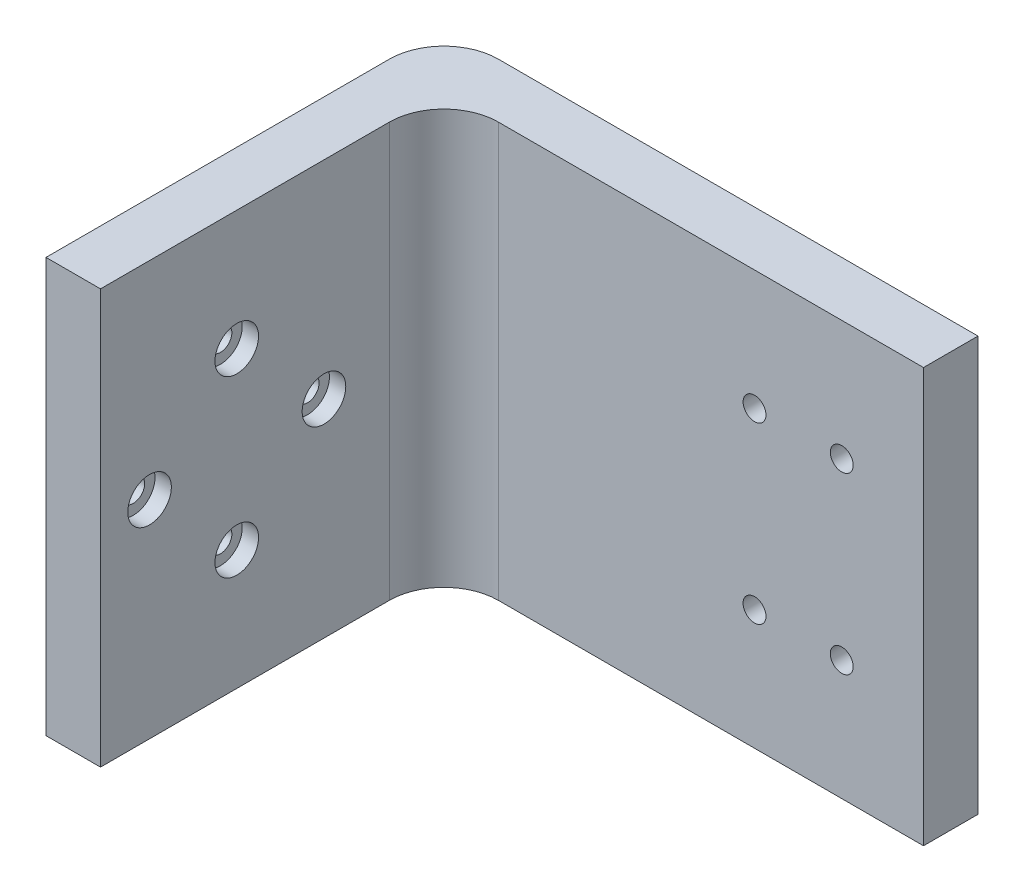
ISO-10303-21;
HEADER;
FILE_DESCRIPTION(('STEP AP214'),'2;1');
FILE_NAME('part.step','',(''),(''),'','','');
FILE_SCHEMA(('AUTOMOTIVE_DESIGN { 1 0 10303 214 1 1 1 1 }'));
ENDSEC;
DATA;
#1=APPLICATION_CONTEXT('core data for automotive mechanical design processes');
#2=APPLICATION_PROTOCOL_DEFINITION('international standard','automotive_design',2000,#1);
#3=PRODUCT_CONTEXT('',#1,'mechanical');
#4=PRODUCT('Part','Part','',(#3));
#5=PRODUCT_RELATED_PRODUCT_CATEGORY('part','',(#4));
#6=PRODUCT_DEFINITION_FORMATION('','',#4);
#7=PRODUCT_DEFINITION_CONTEXT('part definition',#1,'design');
#8=PRODUCT_DEFINITION('design','',#6,#7);
#9=PRODUCT_DEFINITION_SHAPE('','',#8);
#10=(LENGTH_UNIT() NAMED_UNIT(*) SI_UNIT(.MILLI.,.METRE.));
#11=(NAMED_UNIT(*) PLANE_ANGLE_UNIT() SI_UNIT($,.RADIAN.));
#12=(NAMED_UNIT(*) SI_UNIT($,.STERADIAN.) SOLID_ANGLE_UNIT());
#13=UNCERTAINTY_MEASURE_WITH_UNIT(LENGTH_MEASURE(1.E-05),#10,'distance_accuracy_value','');
#14=(GEOMETRIC_REPRESENTATION_CONTEXT(3) GLOBAL_UNCERTAINTY_ASSIGNED_CONTEXT((#13)) GLOBAL_UNIT_ASSIGNED_CONTEXT((#10,
#11,#12)) REPRESENTATION_CONTEXT('',''));
#15=CARTESIAN_POINT('',(0.,0.,0.));
#16=DIRECTION('',(0.,0.,1.));
#17=DIRECTION('',(1.,0.,0.));
#18=AXIS2_PLACEMENT_3D('',#15,#16,#17);
#19=CARTESIAN_POINT('',(5.,8.00000000000001,0.));
#20=DIRECTION('',(-1.,0.,0.));
#21=DIRECTION('',(0.,0.,1.));
#22=AXIS2_PLACEMENT_3D('',#19,#20,#21);
#23=CYLINDRICAL_SURFACE('',#22,1.05);
#24=CARTESIAN_POINT('',(0.,8.00000000000001,0.));
#25=DIRECTION('',(1.,0.,0.));
#26=DIRECTION('',(0.,0.,-1.));
#27=AXIS2_PLACEMENT_3D('',#24,#25,#26);
#28=CIRCLE('',#27,1.05);
#29=CARTESIAN_POINT('',(0.,8.00000000000001,-1.04999999999997));
#30=VERTEX_POINT('',#29);
#31=EDGE_CURVE('E138',#30,#30,#28,.T.);
#32=ORIENTED_EDGE('',*,*,#31,.F.);
#33=EDGE_LOOP('',(#32));
#34=FACE_BOUND('',#33,.T.);
#35=CARTESIAN_POINT('',(3.5,8.00000000000001,0.));
#36=DIRECTION('',(1.,0.,0.));
#37=DIRECTION('',(0.,0.,-1.));
#38=AXIS2_PLACEMENT_3D('',#35,#36,#37);
#39=CIRCLE('',#38,1.05);
#40=CARTESIAN_POINT('',(3.5,8.00000000000001,-1.04999999999997));
#41=VERTEX_POINT('',#40);
#42=EDGE_CURVE('E37',#41,#41,#39,.T.);
#43=ORIENTED_EDGE('',*,*,#42,.T.);
#44=EDGE_LOOP('',(#43));
#45=FACE_BOUND('',#44,.T.);
#46=ADVANCED_FACE('F33',(#34,#45),#23,.F.);
#47=CARTESIAN_POINT('',(5.,0.,-7.99999999999999));
#48=DIRECTION('',(-1.,0.,0.));
#49=DIRECTION('',(0.,0.,1.));
#50=AXIS2_PLACEMENT_3D('',#47,#48,#49);
#51=CYLINDRICAL_SURFACE('',#50,1.05);
#52=CARTESIAN_POINT('',(0.,0.,-7.99999999999999));
#53=DIRECTION('',(1.,0.,0.));
#54=DIRECTION('',(0.,0.,-1.));
#55=AXIS2_PLACEMENT_3D('',#52,#53,#54);
#56=CIRCLE('',#55,1.05);
#57=CARTESIAN_POINT('',(0.,0.,-9.04999999999999));
#58=VERTEX_POINT('',#57);
#59=EDGE_CURVE('E135',#58,#58,#56,.T.);
#60=ORIENTED_EDGE('',*,*,#59,.F.);
#61=EDGE_LOOP('',(#60));
#62=FACE_BOUND('',#61,.T.);
#63=CARTESIAN_POINT('',(3.5,0.,-7.99999999999999));
#64=DIRECTION('',(1.,0.,0.));
#65=DIRECTION('',(0.,0.,-1.));
#66=AXIS2_PLACEMENT_3D('',#63,#64,#65);
#67=CIRCLE('',#66,1.05);
#68=CARTESIAN_POINT('',(3.5,0.,-9.04999999999999));
#69=VERTEX_POINT('',#68);
#70=EDGE_CURVE('E194',#69,#69,#67,.T.);
#71=ORIENTED_EDGE('',*,*,#70,.T.);
#72=EDGE_LOOP('',(#71));
#73=FACE_BOUND('',#72,.T.);
#74=ADVANCED_FACE('F259',(#62,#73),#51,.F.);
#75=CARTESIAN_POINT('',(5.,-8.00000000000001,0.));
#76=DIRECTION('',(-1.,0.,0.));
#77=DIRECTION('',(0.,0.,1.));
#78=AXIS2_PLACEMENT_3D('',#75,#76,#77);
#79=CYLINDRICAL_SURFACE('',#78,1.05);
#80=CARTESIAN_POINT('',(0.,-8.00000000000001,0.));
#81=DIRECTION('',(1.,0.,0.));
#82=DIRECTION('',(0.,0.,-1.));
#83=AXIS2_PLACEMENT_3D('',#80,#81,#82);
#84=CIRCLE('',#83,1.05);
#85=CARTESIAN_POINT('',(0.,-8.00000000000001,-1.05000000000002));
#86=VERTEX_POINT('',#85);
#87=EDGE_CURVE('E123',#86,#86,#84,.T.);
#88=ORIENTED_EDGE('',*,*,#87,.F.);
#89=EDGE_LOOP('',(#88));
#90=FACE_BOUND('',#89,.T.);
#91=CARTESIAN_POINT('',(3.5,-8.00000000000001,0.));
#92=DIRECTION('',(1.,0.,0.));
#93=DIRECTION('',(0.,0.,-1.));
#94=AXIS2_PLACEMENT_3D('',#91,#92,#93);
#95=CIRCLE('',#94,1.05);
#96=CARTESIAN_POINT('',(3.5,-8.00000000000001,-1.05000000000002));
#97=VERTEX_POINT('',#96);
#98=EDGE_CURVE('E191',#97,#97,#95,.T.);
#99=ORIENTED_EDGE('',*,*,#98,.T.);
#100=EDGE_LOOP('',(#99));
#101=FACE_BOUND('',#100,.T.);
#102=ADVANCED_FACE('F265',(#90,#101),#79,.F.);
#103=CARTESIAN_POINT('',(5.,0.,7.99999999999999));
#104=DIRECTION('',(-1.,0.,0.));
#105=DIRECTION('',(0.,0.,1.));
#106=AXIS2_PLACEMENT_3D('',#103,#104,#105);
#107=CYLINDRICAL_SURFACE('',#106,1.05000000000001);
#108=CARTESIAN_POINT('',(0.,0.,7.99999999999999));
#109=DIRECTION('',(1.,0.,0.));
#110=DIRECTION('',(0.,0.,-1.));
#111=AXIS2_PLACEMENT_3D('',#108,#109,#110);
#112=CIRCLE('',#111,1.05000000000001);
#113=CARTESIAN_POINT('',(0.,0.,6.94999999999998));
#114=VERTEX_POINT('',#113);
#115=EDGE_CURVE('E119',#114,#114,#112,.T.);
#116=ORIENTED_EDGE('',*,*,#115,.F.);
#117=EDGE_LOOP('',(#116));
#118=FACE_BOUND('',#117,.T.);
#119=CARTESIAN_POINT('',(3.5,0.,7.99999999999999));
#120=DIRECTION('',(1.,0.,0.));
#121=DIRECTION('',(0.,0.,-1.));
#122=AXIS2_PLACEMENT_3D('',#119,#120,#121);
#123=CIRCLE('',#122,1.05000000000001);
#124=CARTESIAN_POINT('',(3.5,0.,6.94999999999998));
#125=VERTEX_POINT('',#124);
#126=EDGE_CURVE('E188',#125,#125,#123,.T.);
#127=ORIENTED_EDGE('',*,*,#126,.T.);
#128=EDGE_LOOP('',(#127));
#129=FACE_BOUND('',#128,.T.);
#130=ADVANCED_FACE('F393',(#118,#129),#107,.F.);
#131=CARTESIAN_POINT('',(33.5,7.99999999999996,-24.0000000000001));
#132=DIRECTION('',(0.,0.,1.));
#133=DIRECTION('',(1.,0.,0.));
#134=AXIS2_PLACEMENT_3D('',#131,#132,#133);
#135=CYLINDRICAL_SURFACE('',#134,1.05);
#136=CARTESIAN_POINT('',(33.5,7.99999999999996,-19.0000000000001));
#137=DIRECTION('',(0.,0.,1.));
#138=DIRECTION('',(1.,0.,0.));
#139=AXIS2_PLACEMENT_3D('',#136,#137,#138);
#140=CIRCLE('',#139,1.05);
#141=CARTESIAN_POINT('',(34.55,7.99999999999996,-19.0000000000001));
#142=VERTEX_POINT('',#141);
#143=EDGE_CURVE('E131',#142,#142,#140,.T.);
#144=ORIENTED_EDGE('',*,*,#143,.T.);
#145=EDGE_LOOP('',(#144));
#146=FACE_BOUND('',#145,.T.);
#147=CARTESIAN_POINT('',(33.5,7.99999999999996,-22.5000000000001));
#148=DIRECTION('',(0.,0.,-1.));
#149=DIRECTION('',(-1.,0.,0.));
#150=AXIS2_PLACEMENT_3D('',#147,#148,#149);
#151=CIRCLE('',#150,1.05);
#152=CARTESIAN_POINT('',(32.45,7.99999999999996,-22.5000000000001));
#153=VERTEX_POINT('',#152);
#154=EDGE_CURVE('E184',#153,#153,#151,.F.);
#155=ORIENTED_EDGE('',*,*,#154,.F.);
#156=EDGE_LOOP('',(#155));
#157=FACE_BOUND('',#156,.T.);
#158=ADVANCED_FACE('F238',(#146,#157),#135,.F.);
#159=CARTESIAN_POINT('',(33.5000000000001,-8.00000000000006,-24.0000000000001));
#160=DIRECTION('',(0.,0.,1.));
#161=DIRECTION('',(1.,0.,0.));
#162=AXIS2_PLACEMENT_3D('',#159,#160,#161);
#163=CYLINDRICAL_SURFACE('',#162,1.05);
#164=CARTESIAN_POINT('',(33.5000000000001,-8.00000000000006,-19.0000000000001));
#165=DIRECTION('',(0.,0.,1.));
#166=DIRECTION('',(-1.,0.,0.));
#167=AXIS2_PLACEMENT_3D('',#164,#165,#166);
#168=CIRCLE('',#167,1.05);
#169=CARTESIAN_POINT('',(32.4500000000001,-8.00000000000006,-19.0000000000001));
#170=VERTEX_POINT('',#169);
#171=EDGE_CURVE('E228',#170,#170,#168,.T.);
#172=ORIENTED_EDGE('',*,*,#171,.T.);
#173=EDGE_LOOP('',(#172));
#174=FACE_BOUND('',#173,.T.);
#175=CARTESIAN_POINT('',(33.5000000000001,-8.00000000000006,-22.5000000000001));
#176=DIRECTION('',(0.,0.,-1.));
#177=DIRECTION('',(-1.,0.,0.));
#178=AXIS2_PLACEMENT_3D('',#175,#176,#177);
#179=CIRCLE('',#178,1.05);
#180=CARTESIAN_POINT('',(32.4500000000001,-8.00000000000006,-22.5000000000001));
#181=VERTEX_POINT('',#180);
#182=EDGE_CURVE('E181',#181,#181,#179,.F.);
#183=ORIENTED_EDGE('',*,*,#182,.F.);
#184=EDGE_LOOP('',(#183));
#185=FACE_BOUND('',#184,.T.);
#186=ADVANCED_FACE('F381',(#174,#185),#163,.F.);
#187=CARTESIAN_POINT('',(41.5,-8.00000000000006,-24.0000000000001));
#188=DIRECTION('',(0.,0.,1.));
#189=DIRECTION('',(1.,0.,0.));
#190=AXIS2_PLACEMENT_3D('',#187,#188,#189);
#191=CYLINDRICAL_SURFACE('',#190,1.05);
#192=CARTESIAN_POINT('',(41.5,-8.00000000000006,-19.0000000000001));
#193=DIRECTION('',(0.,0.,1.));
#194=DIRECTION('',(1.,0.,0.));
#195=AXIS2_PLACEMENT_3D('',#192,#193,#194);
#196=CIRCLE('',#195,1.05);
#197=CARTESIAN_POINT('',(42.55,-8.00000000000006,-19.0000000000001));
#198=VERTEX_POINT('',#197);
#199=EDGE_CURVE('E231',#198,#198,#196,.T.);
#200=ORIENTED_EDGE('',*,*,#199,.T.);
#201=EDGE_LOOP('',(#200));
#202=FACE_BOUND('',#201,.T.);
#203=CARTESIAN_POINT('',(41.5,-8.00000000000006,-22.5000000000001));
#204=DIRECTION('',(0.,0.,-1.));
#205=DIRECTION('',(-1.,0.,0.));
#206=AXIS2_PLACEMENT_3D('',#203,#204,#205);
#207=CIRCLE('',#206,1.05);
#208=CARTESIAN_POINT('',(40.45,-8.00000000000006,-22.5000000000001));
#209=VERTEX_POINT('',#208);
#210=EDGE_CURVE('E177',#209,#209,#207,.F.);
#211=ORIENTED_EDGE('',*,*,#210,.F.);
#212=EDGE_LOOP('',(#211));
#213=FACE_BOUND('',#212,.T.);
#214=ADVANCED_FACE('F384',(#202,#213),#191,.F.);
#215=CARTESIAN_POINT('',(41.5,7.99999999999996,-24.0000000000001));
#216=DIRECTION('',(0.,0.,1.));
#217=DIRECTION('',(1.,0.,0.));
#218=AXIS2_PLACEMENT_3D('',#215,#216,#217);
#219=CYLINDRICAL_SURFACE('',#218,1.05);
#220=CARTESIAN_POINT('',(41.5,7.99999999999996,-19.0000000000001));
#221=DIRECTION('',(0.,0.,1.));
#222=DIRECTION('',(1.,0.,0.));
#223=AXIS2_PLACEMENT_3D('',#220,#221,#222);
#224=CIRCLE('',#223,1.05);
#225=CARTESIAN_POINT('',(42.55,7.99999999999996,-19.0000000000001));
#226=VERTEX_POINT('',#225);
#227=EDGE_CURVE('E187',#226,#226,#224,.T.);
#228=ORIENTED_EDGE('',*,*,#227,.T.);
#229=EDGE_LOOP('',(#228));
#230=FACE_BOUND('',#229,.T.);
#231=CARTESIAN_POINT('',(41.5,7.99999999999996,-22.5000000000001));
#232=DIRECTION('',(0.,0.,-1.));
#233=DIRECTION('',(-1.,0.,0.));
#234=AXIS2_PLACEMENT_3D('',#231,#232,#233);
#235=CIRCLE('',#234,1.05);
#236=CARTESIAN_POINT('',(40.45,7.99999999999996,-22.5000000000001));
#237=VERTEX_POINT('',#236);
#238=EDGE_CURVE('E174',#237,#237,#235,.F.);
#239=ORIENTED_EDGE('',*,*,#238,.F.);
#240=EDGE_LOOP('',(#239));
#241=FACE_BOUND('',#240,.T.);
#242=ADVANCED_FACE('F275',(#230,#241),#219,.F.);
#243=CARTESIAN_POINT('',(5.,0.,0.));
#244=DIRECTION('',(1.,0.,0.));
#245=DIRECTION('',(0.,0.,-1.));
#246=AXIS2_PLACEMENT_3D('',#243,#244,#245);
#247=PLANE('',#246);
#248=CARTESIAN_POINT('',(5.,8.00000000000001,0.));
#249=DIRECTION('',(1.,0.,0.));
#250=DIRECTION('',(0.,0.,-1.));
#251=AXIS2_PLACEMENT_3D('',#248,#249,#250);
#252=CIRCLE('',#251,2.);
#253=CARTESIAN_POINT('',(5.,8.00000000000001,-1.99999999999997));
#254=VERTEX_POINT('',#253);
#255=EDGE_CURVE('E309',#254,#254,#252,.T.);
#256=ORIENTED_EDGE('',*,*,#255,.F.);
#257=EDGE_LOOP('',(#256));
#258=FACE_BOUND('',#257,.T.);
#259=CARTESIAN_POINT('',(5.,0.,7.99999999999999));
#260=DIRECTION('',(1.,0.,0.));
#261=DIRECTION('',(0.,0.,-1.));
#262=AXIS2_PLACEMENT_3D('',#259,#260,#261);
#263=CIRCLE('',#262,2.);
#264=CARTESIAN_POINT('',(5.,0.,5.99999999999999));
#265=VERTEX_POINT('',#264);
#266=EDGE_CURVE('E315',#265,#265,#263,.T.);
#267=ORIENTED_EDGE('',*,*,#266,.F.);
#268=EDGE_LOOP('',(#267));
#269=FACE_BOUND('',#268,.T.);
#270=CARTESIAN_POINT('',(5.,-8.00000000000001,0.));
#271=DIRECTION('',(1.,0.,0.));
#272=DIRECTION('',(0.,0.,-1.));
#273=AXIS2_PLACEMENT_3D('',#270,#271,#272);
#274=CIRCLE('',#273,2.);
#275=CARTESIAN_POINT('',(5.,-8.00000000000001,-2.00000000000003));
#276=VERTEX_POINT('',#275);
#277=EDGE_CURVE('E321',#276,#276,#274,.T.);
#278=ORIENTED_EDGE('',*,*,#277,.F.);
#279=EDGE_LOOP('',(#278));
#280=FACE_BOUND('',#279,.T.);
#281=CARTESIAN_POINT('',(5.,0.,-7.99999999999999));
#282=DIRECTION('',(1.,0.,0.));
#283=DIRECTION('',(0.,0.,-1.));
#284=AXIS2_PLACEMENT_3D('',#281,#282,#283);
#285=CIRCLE('',#284,2.);
#286=CARTESIAN_POINT('',(5.,0.,-9.99999999999999));
#287=VERTEX_POINT('',#286);
#288=EDGE_CURVE('E306',#287,#287,#285,.T.);
#289=ORIENTED_EDGE('',*,*,#288,.F.);
#290=EDGE_LOOP('',(#289));
#291=FACE_BOUND('',#290,.T.);
#292=DIRECTION('',(0.,0.,-1.));
#293=VECTOR('',#292,1.);
#294=CARTESIAN_POINT('',(5.,-19.,12.4999999999999));
#295=LINE('',#294,#293);
#296=CARTESIAN_POINT('',(5.,-19.,12.4999999999999));
#297=VERTEX_POINT('',#296);
#298=CARTESIAN_POINT('',(5.,-19.,-14.0000000000001));
#299=VERTEX_POINT('',#298);
#300=EDGE_CURVE('E147',#297,#299,#295,.T.);
#301=ORIENTED_EDGE('',*,*,#300,.T.);
#302=DIRECTION('',(0.,1.,0.));
#303=VECTOR('',#302,1.);
#304=CARTESIAN_POINT('',(5.,18.9999999999999,-14.0000000000001));
#305=LINE('',#304,#303);
#306=CARTESIAN_POINT('',(5.,18.9999999999999,-14.0000000000001));
#307=VERTEX_POINT('',#306);
#308=EDGE_CURVE('E169',#299,#307,#305,.T.);
#309=ORIENTED_EDGE('',*,*,#308,.T.);
#310=DIRECTION('',(0.,0.,1.));
#311=VECTOR('',#310,1.);
#312=CARTESIAN_POINT('',(5.,18.9999999999999,-19.0000000000001));
#313=LINE('',#312,#311);
#314=CARTESIAN_POINT('',(5.,18.9999999999999,12.5000000000001));
#315=VERTEX_POINT('',#314);
#316=EDGE_CURVE('E142',#307,#315,#313,.T.);
#317=ORIENTED_EDGE('',*,*,#316,.T.);
#318=DIRECTION('',(0.,-1.,0.));
#319=VECTOR('',#318,1.);
#320=CARTESIAN_POINT('',(5.,18.9999999999999,12.5000000000001));
#321=LINE('',#320,#319);
#322=EDGE_CURVE('E144',#315,#297,#321,.T.);
#323=ORIENTED_EDGE('',*,*,#322,.T.);
#324=EDGE_LOOP('',(#301,#309,#317,#323));
#325=FACE_BOUND('',#324,.T.);
#326=ADVANCED_FACE('F271',(#258,#269,#280,#291,#325),#247,.T.);
#327=CARTESIAN_POINT('',(0.,0.,0.));
#328=DIRECTION('',(1.,0.,0.));
#329=DIRECTION('',(0.,0.,-1.));
#330=AXIS2_PLACEMENT_3D('',#327,#328,#329);
#331=PLANE('',#330);
#332=DIRECTION('',(0.,0.,1.));
#333=VECTOR('',#332,1.);
#334=CARTESIAN_POINT('',(0.,18.9999999999999,-19.0000000000001));
#335=LINE('',#334,#333);
#336=CARTESIAN_POINT('',(0.,18.9999999999999,-19.0000000000001));
#337=VERTEX_POINT('',#336);
#338=CARTESIAN_POINT('',(0.,18.9999999999999,12.5000000000001));
#339=VERTEX_POINT('',#338);
#340=EDGE_CURVE('E141',#337,#339,#335,.T.);
#341=ORIENTED_EDGE('',*,*,#340,.F.);
#342=DIRECTION('',(0.,-1.,0.));
#343=VECTOR('',#342,1.);
#344=CARTESIAN_POINT('',(0.,0.,-19.0000000000001));
#345=LINE('',#344,#343);
#346=CARTESIAN_POINT('',(0.,-18.9999999999999,-19.0000000000001));
#347=VERTEX_POINT('',#346);
#348=EDGE_CURVE('E161',#337,#347,#345,.T.);
#349=ORIENTED_EDGE('',*,*,#348,.T.);
#350=DIRECTION('',(0.,0.,-1.));
#351=VECTOR('',#350,1.);
#352=CARTESIAN_POINT('',(0.,-19.,12.4999999999999));
#353=LINE('',#352,#351);
#354=CARTESIAN_POINT('',(0.,-19.,12.4999999999999));
#355=VERTEX_POINT('',#354);
#356=EDGE_CURVE('E145',#355,#347,#353,.T.);
#357=ORIENTED_EDGE('',*,*,#356,.F.);
#358=DIRECTION('',(0.,-1.,0.));
#359=VECTOR('',#358,1.);
#360=CARTESIAN_POINT('',(0.,18.9999999999999,12.5000000000001));
#361=LINE('',#360,#359);
#362=EDGE_CURVE('E152',#339,#355,#361,.T.);
#363=ORIENTED_EDGE('',*,*,#362,.F.);
#364=EDGE_LOOP('',(#341,#349,#357,#363));
#365=FACE_BOUND('',#364,.T.);
#366=ORIENTED_EDGE('',*,*,#31,.T.);
#367=EDGE_LOOP('',(#366));
#368=FACE_BOUND('',#367,.T.);
#369=ORIENTED_EDGE('',*,*,#59,.T.);
#370=EDGE_LOOP('',(#369));
#371=FACE_BOUND('',#370,.T.);
#372=ORIENTED_EDGE('',*,*,#87,.T.);
#373=EDGE_LOOP('',(#372));
#374=FACE_BOUND('',#373,.T.);
#375=ORIENTED_EDGE('',*,*,#115,.T.);
#376=EDGE_LOOP('',(#375));
#377=FACE_BOUND('',#376,.T.);
#378=ADVANCED_FACE('F274',(#365,#368,#371,#374,#377),#331,.F.);
#379=CARTESIAN_POINT('',(5.,18.9999999999999,-19.0000000000001));
#380=DIRECTION('',(0.,-1.,0.));
#381=DIRECTION('',(0.,0.,-1.));
#382=AXIS2_PLACEMENT_3D('',#379,#380,#381);
#383=PLANE('',#382);
#384=DIRECTION('',(1.,0.,0.));
#385=VECTOR('',#384,1.);
#386=CARTESIAN_POINT('',(0.,18.9999999999999,-19.0000000000001));
#387=LINE('',#386,#385);
#388=CARTESIAN_POINT('',(10.,18.9999999999999,-19.0000000000001));
#389=VERTEX_POINT('',#388);
#390=CARTESIAN_POINT('',(49.,18.9999999999999,-19.0000000000001));
#391=VERTEX_POINT('',#390);
#392=EDGE_CURVE('E114',#389,#391,#387,.T.);
#393=ORIENTED_EDGE('',*,*,#392,.T.);
#394=DIRECTION('',(0.,0.,1.));
#395=VECTOR('',#394,1.);
#396=CARTESIAN_POINT('',(49.,18.9999999999999,-24.0000000000001));
#397=LINE('',#396,#395);
#398=CARTESIAN_POINT('',(49.,18.9999999999999,-24.0000000000001));
#399=VERTEX_POINT('',#398);
#400=EDGE_CURVE('E99',#399,#391,#397,.T.);
#401=ORIENTED_EDGE('',*,*,#400,.F.);
#402=DIRECTION('',(1.,0.,0.));
#403=VECTOR('',#402,1.);
#404=CARTESIAN_POINT('',(0.,18.9999999999999,-24.0000000000001));
#405=LINE('',#404,#403);
#406=CARTESIAN_POINT('',(5.,18.9999999999999,-24.0000000000001));
#407=VERTEX_POINT('',#406);
#408=EDGE_CURVE('E111',#407,#399,#405,.T.);
#409=ORIENTED_EDGE('',*,*,#408,.F.);
#410=CARTESIAN_POINT('',(5.,18.9999999999999,-19.0000000000001));
#411=DIRECTION('',(0.,-1.,0.));
#412=DIRECTION('',(0.,0.,-1.));
#413=AXIS2_PLACEMENT_3D('',#410,#411,#412);
#414=CIRCLE('',#413,5.);
#415=EDGE_CURVE('E167',#407,#337,#414,.F.);
#416=ORIENTED_EDGE('',*,*,#415,.T.);
#417=ORIENTED_EDGE('',*,*,#340,.T.);
#418=DIRECTION('',(-1.,0.,0.));
#419=VECTOR('',#418,1.);
#420=CARTESIAN_POINT('',(5.,18.9999999999999,12.5000000000001));
#421=LINE('',#420,#419);
#422=EDGE_CURVE('E158',#315,#339,#421,.T.);
#423=ORIENTED_EDGE('',*,*,#422,.F.);
#424=ORIENTED_EDGE('',*,*,#316,.F.);
#425=CARTESIAN_POINT('',(10.,18.9999999999999,-14.0000000000001));
#426=DIRECTION('',(0.,-1.,0.));
#427=DIRECTION('',(0.,0.,-1.));
#428=AXIS2_PLACEMENT_3D('',#425,#426,#427);
#429=CIRCLE('',#428,5.);
#430=EDGE_CURVE('E42',#307,#389,#429,.T.);
#431=ORIENTED_EDGE('',*,*,#430,.T.);
#432=EDGE_LOOP('',(#393,#401,#409,#416,#417,#423,#424,#431));
#433=FACE_BOUND('',#432,.T.);
#434=ADVANCED_FACE('F110',(#433),#383,.F.);
#435=CARTESIAN_POINT('',(5.,18.9999999999999,12.5000000000001));
#436=DIRECTION('',(0.,0.,-1.));
#437=DIRECTION('',(0.,1.,0.));
#438=AXIS2_PLACEMENT_3D('',#435,#436,#437);
#439=PLANE('',#438);
#440=ORIENTED_EDGE('',*,*,#362,.T.);
#441=DIRECTION('',(-1.,0.,0.));
#442=VECTOR('',#441,1.);
#443=CARTESIAN_POINT('',(5.,-19.,12.4999999999999));
#444=LINE('',#443,#442);
#445=EDGE_CURVE('E150',#297,#355,#444,.T.);
#446=ORIENTED_EDGE('',*,*,#445,.F.);
#447=ORIENTED_EDGE('',*,*,#322,.F.);
#448=ORIENTED_EDGE('',*,*,#422,.T.);
#449=EDGE_LOOP('',(#440,#446,#447,#448));
#450=FACE_BOUND('',#449,.T.);
#451=ADVANCED_FACE('F253',(#450),#439,.F.);
#452=CARTESIAN_POINT('',(5.,-19.,12.4999999999999));
#453=DIRECTION('',(0.,1.,0.));
#454=DIRECTION('',(0.,0.,1.));
#455=AXIS2_PLACEMENT_3D('',#452,#453,#454);
#456=PLANE('',#455);
#457=DIRECTION('',(1.,0.,0.));
#458=VECTOR('',#457,1.);
#459=CARTESIAN_POINT('',(0.,-18.9999999999999,-24.0000000000001));
#460=LINE('',#459,#458);
#461=CARTESIAN_POINT('',(5.,-18.9999999999999,-24.0000000000001));
#462=VERTEX_POINT('',#461);
#463=CARTESIAN_POINT('',(49.,-18.9999999999999,-24.0000000000001));
#464=VERTEX_POINT('',#463);
#465=EDGE_CURVE('E120',#462,#464,#460,.T.);
#466=ORIENTED_EDGE('',*,*,#465,.T.);
#467=DIRECTION('',(0.,0.,1.));
#468=VECTOR('',#467,1.);
#469=CARTESIAN_POINT('',(49.,-19.,-24.0000000000001));
#470=LINE('',#469,#468);
#471=CARTESIAN_POINT('',(49.,-19.,-19.0000000000001));
#472=VERTEX_POINT('',#471);
#473=EDGE_CURVE('E50',#464,#472,#470,.T.);
#474=ORIENTED_EDGE('',*,*,#473,.T.);
#475=DIRECTION('',(1.,0.,0.));
#476=VECTOR('',#475,1.);
#477=CARTESIAN_POINT('',(0.,-18.9999999999999,-19.0000000000001));
#478=LINE('',#477,#476);
#479=CARTESIAN_POINT('',(10.,-18.9999999999999,-19.0000000000001));
#480=VERTEX_POINT('',#479);
#481=EDGE_CURVE('E128',#480,#472,#478,.T.);
#482=ORIENTED_EDGE('',*,*,#481,.F.);
#483=CARTESIAN_POINT('',(10.,-19.,-14.0000000000001));
#484=DIRECTION('',(0.,1.,0.));
#485=DIRECTION('',(0.,0.,1.));
#486=AXIS2_PLACEMENT_3D('',#483,#484,#485);
#487=CIRCLE('',#486,5.);
#488=EDGE_CURVE('E11',#480,#299,#487,.T.);
#489=ORIENTED_EDGE('',*,*,#488,.T.);
#490=ORIENTED_EDGE('',*,*,#300,.F.);
#491=ORIENTED_EDGE('',*,*,#445,.T.);
#492=ORIENTED_EDGE('',*,*,#356,.T.);
#493=CARTESIAN_POINT('',(5.,-18.9999999999999,-19.0000000000001));
#494=DIRECTION('',(0.,1.,0.));
#495=DIRECTION('',(0.,0.,1.));
#496=AXIS2_PLACEMENT_3D('',#493,#494,#495);
#497=CIRCLE('',#496,5.);
#498=EDGE_CURVE('E164',#347,#462,#497,.F.);
#499=ORIENTED_EDGE('',*,*,#498,.T.);
#500=EDGE_LOOP('',(#466,#474,#482,#489,#490,#491,#492,#499));
#501=FACE_BOUND('',#500,.T.);
#502=ADVANCED_FACE('F243',(#501),#456,.F.);
#503=CARTESIAN_POINT('',(0.,0.,-19.0000000000001));
#504=DIRECTION('',(0.,0.,1.));
#505=DIRECTION('',(1.,0.,0.));
#506=AXIS2_PLACEMENT_3D('',#503,#504,#505);
#507=PLANE('',#506);
#508=DIRECTION('',(0.,-1.,0.));
#509=VECTOR('',#508,1.);
#510=CARTESIAN_POINT('',(49.,0.,-19.0000000000001));
#511=LINE('',#510,#509);
#512=EDGE_CURVE('E105',#391,#472,#511,.T.);
#513=ORIENTED_EDGE('',*,*,#512,.F.);
#514=ORIENTED_EDGE('',*,*,#392,.F.);
#515=DIRECTION('',(0.,1.,0.));
#516=VECTOR('',#515,1.);
#517=CARTESIAN_POINT('',(10.,-18.9999999999999,-19.0000000000001));
#518=LINE('',#517,#516);
#519=EDGE_CURVE('E171',#389,#480,#518,.F.);
#520=ORIENTED_EDGE('',*,*,#519,.T.);
#521=ORIENTED_EDGE('',*,*,#481,.T.);
#522=EDGE_LOOP('',(#513,#514,#520,#521));
#523=FACE_BOUND('',#522,.T.);
#524=ORIENTED_EDGE('',*,*,#227,.F.);
#525=EDGE_LOOP('',(#524));
#526=FACE_BOUND('',#525,.T.);
#527=ORIENTED_EDGE('',*,*,#199,.F.);
#528=EDGE_LOOP('',(#527));
#529=FACE_BOUND('',#528,.T.);
#530=ORIENTED_EDGE('',*,*,#171,.F.);
#531=EDGE_LOOP('',(#530));
#532=FACE_BOUND('',#531,.T.);
#533=ORIENTED_EDGE('',*,*,#143,.F.);
#534=EDGE_LOOP('',(#533));
#535=FACE_BOUND('',#534,.T.);
#536=ADVANCED_FACE('F241',(#523,#526,#529,#532,#535),#507,.T.);
#537=CARTESIAN_POINT('',(0.,0.,-24.0000000000001));
#538=DIRECTION('',(0.,0.,1.));
#539=DIRECTION('',(1.,0.,0.));
#540=AXIS2_PLACEMENT_3D('',#537,#538,#539);
#541=PLANE('',#540);
#542=CARTESIAN_POINT('',(33.5,7.99999999999996,-24.0000000000001));
#543=DIRECTION('',(0.,0.,-1.));
#544=DIRECTION('',(-1.,0.,0.));
#545=AXIS2_PLACEMENT_3D('',#542,#543,#544);
#546=CIRCLE('',#545,2.);
#547=CARTESIAN_POINT('',(31.5,7.99999999999996,-24.0000000000001));
#548=VERTEX_POINT('',#547);
#549=EDGE_CURVE('E216',#548,#548,#546,.T.);
#550=ORIENTED_EDGE('',*,*,#549,.F.);
#551=EDGE_LOOP('',(#550));
#552=FACE_BOUND('',#551,.T.);
#553=CARTESIAN_POINT('',(41.5,-8.00000000000006,-24.0000000000001));
#554=DIRECTION('',(0.,0.,-1.));
#555=DIRECTION('',(-1.,0.,0.));
#556=AXIS2_PLACEMENT_3D('',#553,#554,#555);
#557=CIRCLE('',#556,2.);
#558=CARTESIAN_POINT('',(39.5,-8.00000000000006,-24.0000000000001));
#559=VERTEX_POINT('',#558);
#560=EDGE_CURVE('E208',#559,#559,#557,.T.);
#561=ORIENTED_EDGE('',*,*,#560,.F.);
#562=EDGE_LOOP('',(#561));
#563=FACE_BOUND('',#562,.T.);
#564=CARTESIAN_POINT('',(33.5000000000001,-8.00000000000006,-24.0000000000001));
#565=DIRECTION('',(0.,0.,-1.));
#566=DIRECTION('',(-1.,0.,0.));
#567=AXIS2_PLACEMENT_3D('',#564,#565,#566);
#568=CIRCLE('',#567,2.);
#569=CARTESIAN_POINT('',(31.5000000000001,-8.00000000000006,-24.0000000000001));
#570=VERTEX_POINT('',#569);
#571=EDGE_CURVE('E199',#570,#570,#568,.T.);
#572=ORIENTED_EDGE('',*,*,#571,.F.);
#573=EDGE_LOOP('',(#572));
#574=FACE_BOUND('',#573,.T.);
#575=CARTESIAN_POINT('',(41.5,7.99999999999996,-24.0000000000001));
#576=DIRECTION('',(0.,0.,-1.));
#577=DIRECTION('',(-1.,0.,0.));
#578=AXIS2_PLACEMENT_3D('',#575,#576,#577);
#579=CIRCLE('',#578,2.);
#580=CARTESIAN_POINT('',(39.5,7.99999999999996,-24.0000000000001));
#581=VERTEX_POINT('',#580);
#582=EDGE_CURVE('E215',#581,#581,#579,.T.);
#583=ORIENTED_EDGE('',*,*,#582,.F.);
#584=EDGE_LOOP('',(#583));
#585=FACE_BOUND('',#584,.T.);
#586=ORIENTED_EDGE('',*,*,#408,.T.);
#587=DIRECTION('',(0.,1.,0.));
#588=VECTOR('',#587,1.);
#589=CARTESIAN_POINT('',(49.,-19.,-24.0000000000001));
#590=LINE('',#589,#588);
#591=EDGE_CURVE('E96',#464,#399,#590,.T.);
#592=ORIENTED_EDGE('',*,*,#591,.F.);
#593=ORIENTED_EDGE('',*,*,#465,.F.);
#594=DIRECTION('',(0.,-1.,0.));
#595=VECTOR('',#594,1.);
#596=CARTESIAN_POINT('',(5.,0.,-24.0000000000001));
#597=LINE('',#596,#595);
#598=EDGE_CURVE('E118',#462,#407,#597,.F.);
#599=ORIENTED_EDGE('',*,*,#598,.T.);
#600=EDGE_LOOP('',(#586,#592,#593,#599));
#601=FACE_BOUND('',#600,.T.);
#602=ADVANCED_FACE('F116',(#552,#563,#574,#585,#601),#541,.F.);
#603=CARTESIAN_POINT('',(5.,0.,-19.0000000000001));
#604=DIRECTION('',(0.,-1.,0.));
#605=DIRECTION('',(0.,0.,-1.));
#606=AXIS2_PLACEMENT_3D('',#603,#604,#605);
#607=CYLINDRICAL_SURFACE('',#606,5.);
#608=ORIENTED_EDGE('',*,*,#415,.F.);
#609=ORIENTED_EDGE('',*,*,#598,.F.);
#610=ORIENTED_EDGE('',*,*,#498,.F.);
#611=ORIENTED_EDGE('',*,*,#348,.F.);
#612=EDGE_LOOP('',(#608,#609,#610,#611));
#613=FACE_BOUND('',#612,.T.);
#614=ADVANCED_FACE('F250',(#613),#607,.T.);
#615=CARTESIAN_POINT('',(10.,0.,-14.0000000000001));
#616=DIRECTION('',(0.,-1.,0.));
#617=DIRECTION('',(0.,0.,-1.));
#618=AXIS2_PLACEMENT_3D('',#615,#616,#617);
#619=CYLINDRICAL_SURFACE('',#618,5.);
#620=ORIENTED_EDGE('',*,*,#488,.F.);
#621=ORIENTED_EDGE('',*,*,#519,.F.);
#622=ORIENTED_EDGE('',*,*,#430,.F.);
#623=ORIENTED_EDGE('',*,*,#308,.F.);
#624=EDGE_LOOP('',(#620,#621,#622,#623));
#625=FACE_BOUND('',#624,.T.);
#626=ADVANCED_FACE('F35',(#625),#619,.F.);
#627=CARTESIAN_POINT('',(41.5,7.99999999999996,-22.5000000000001));
#628=DIRECTION('',(0.,0.,-1.));
#629=DIRECTION('',(-1.,0.,0.));
#630=AXIS2_PLACEMENT_3D('',#627,#628,#629);
#631=PLANE('',#630);
#632=CARTESIAN_POINT('',(41.5,7.99999999999996,-22.5000000000001));
#633=DIRECTION('',(0.,0.,-1.));
#634=DIRECTION('',(-1.,0.,0.));
#635=AXIS2_PLACEMENT_3D('',#632,#633,#634);
#636=CIRCLE('',#635,2.);
#637=CARTESIAN_POINT('',(39.5,7.99999999999996,-22.5000000000001));
#638=VERTEX_POINT('',#637);
#639=EDGE_CURVE('E178',#638,#638,#636,.T.);
#640=ORIENTED_EDGE('',*,*,#639,.T.);
#641=EDGE_LOOP('',(#640));
#642=FACE_BOUND('',#641,.T.);
#643=ORIENTED_EDGE('',*,*,#238,.T.);
#644=EDGE_LOOP('',(#643));
#645=FACE_BOUND('',#644,.T.);
#646=ADVANCED_FACE('F289',(#642,#645),#631,.T.);
#647=CARTESIAN_POINT('',(41.5,7.99999999999996,-22.5000000000001));
#648=DIRECTION('',(0.,0.,-1.));
#649=DIRECTION('',(-1.,0.,0.));
#650=AXIS2_PLACEMENT_3D('',#647,#648,#649);
#651=CYLINDRICAL_SURFACE('',#650,2.);
#652=ORIENTED_EDGE('',*,*,#639,.F.);
#653=EDGE_LOOP('',(#652));
#654=FACE_BOUND('',#653,.T.);
#655=ORIENTED_EDGE('',*,*,#582,.T.);
#656=EDGE_LOOP('',(#655));
#657=FACE_BOUND('',#656,.T.);
#658=ADVANCED_FACE('F370',(#654,#657),#651,.F.);
#659=CARTESIAN_POINT('',(41.5,-8.00000000000006,-22.5000000000001));
#660=DIRECTION('',(0.,0.,-1.));
#661=DIRECTION('',(-1.,0.,0.));
#662=AXIS2_PLACEMENT_3D('',#659,#660,#661);
#663=PLANE('',#662);
#664=CARTESIAN_POINT('',(41.5,-8.00000000000006,-22.5000000000001));
#665=DIRECTION('',(0.,0.,-1.));
#666=DIRECTION('',(-1.,0.,0.));
#667=AXIS2_PLACEMENT_3D('',#664,#665,#666);
#668=CIRCLE('',#667,2.);
#669=CARTESIAN_POINT('',(39.5,-8.00000000000006,-22.5000000000001));
#670=VERTEX_POINT('',#669);
#671=EDGE_CURVE('E219',#670,#670,#668,.T.);
#672=ORIENTED_EDGE('',*,*,#671,.T.);
#673=EDGE_LOOP('',(#672));
#674=FACE_BOUND('',#673,.T.);
#675=ORIENTED_EDGE('',*,*,#210,.T.);
#676=EDGE_LOOP('',(#675));
#677=FACE_BOUND('',#676,.T.);
#678=ADVANCED_FACE('F367',(#674,#677),#663,.T.);
#679=CARTESIAN_POINT('',(41.5,-8.00000000000006,-22.5000000000001));
#680=DIRECTION('',(0.,0.,-1.));
#681=DIRECTION('',(-1.,0.,0.));
#682=AXIS2_PLACEMENT_3D('',#679,#680,#681);
#683=CYLINDRICAL_SURFACE('',#682,2.);
#684=ORIENTED_EDGE('',*,*,#671,.F.);
#685=EDGE_LOOP('',(#684));
#686=FACE_BOUND('',#685,.T.);
#687=ORIENTED_EDGE('',*,*,#560,.T.);
#688=EDGE_LOOP('',(#687));
#689=FACE_BOUND('',#688,.T.);
#690=ADVANCED_FACE('F353',(#686,#689),#683,.F.);
#691=CARTESIAN_POINT('',(33.5000000000001,-8.00000000000006,-22.5000000000001));
#692=DIRECTION('',(0.,0.,-1.));
#693=DIRECTION('',(-1.,0.,0.));
#694=AXIS2_PLACEMENT_3D('',#691,#692,#693);
#695=PLANE('',#694);
#696=CARTESIAN_POINT('',(33.5000000000001,-8.00000000000006,-22.5000000000001));
#697=DIRECTION('',(0.,0.,-1.));
#698=DIRECTION('',(-1.,0.,0.));
#699=AXIS2_PLACEMENT_3D('',#696,#697,#698);
#700=CIRCLE('',#699,2.);
#701=CARTESIAN_POINT('',(31.5000000000001,-8.00000000000006,-22.5000000000001));
#702=VERTEX_POINT('',#701);
#703=EDGE_CURVE('E203',#702,#702,#700,.T.);
#704=ORIENTED_EDGE('',*,*,#703,.T.);
#705=EDGE_LOOP('',(#704));
#706=FACE_BOUND('',#705,.T.);
#707=ORIENTED_EDGE('',*,*,#182,.T.);
#708=EDGE_LOOP('',(#707));
#709=FACE_BOUND('',#708,.T.);
#710=ADVANCED_FACE('F349',(#706,#709),#695,.T.);
#711=CARTESIAN_POINT('',(33.5000000000001,-8.00000000000006,-22.5000000000001));
#712=DIRECTION('',(0.,0.,-1.));
#713=DIRECTION('',(-1.,0.,0.));
#714=AXIS2_PLACEMENT_3D('',#711,#712,#713);
#715=CYLINDRICAL_SURFACE('',#714,2.);
#716=ORIENTED_EDGE('',*,*,#703,.F.);
#717=EDGE_LOOP('',(#716));
#718=FACE_BOUND('',#717,.T.);
#719=ORIENTED_EDGE('',*,*,#571,.T.);
#720=EDGE_LOOP('',(#719));
#721=FACE_BOUND('',#720,.T.);
#722=ADVANCED_FACE('F352',(#718,#721),#715,.F.);
#723=CARTESIAN_POINT('',(33.5,7.99999999999996,-22.5000000000001));
#724=DIRECTION('',(0.,0.,-1.));
#725=DIRECTION('',(-1.,0.,0.));
#726=AXIS2_PLACEMENT_3D('',#723,#724,#725);
#727=PLANE('',#726);
#728=CARTESIAN_POINT('',(33.5,7.99999999999996,-22.5000000000001));
#729=DIRECTION('',(0.,0.,-1.));
#730=DIRECTION('',(-1.,0.,0.));
#731=AXIS2_PLACEMENT_3D('',#728,#729,#730);
#732=CIRCLE('',#731,2.);
#733=CARTESIAN_POINT('',(31.5,7.99999999999996,-22.5000000000001));
#734=VERTEX_POINT('',#733);
#735=EDGE_CURVE('E212',#734,#734,#732,.T.);
#736=ORIENTED_EDGE('',*,*,#735,.T.);
#737=EDGE_LOOP('',(#736));
#738=FACE_BOUND('',#737,.T.);
#739=ORIENTED_EDGE('',*,*,#154,.T.);
#740=EDGE_LOOP('',(#739));
#741=FACE_BOUND('',#740,.T.);
#742=ADVANCED_FACE('F357',(#738,#741),#727,.T.);
#743=CARTESIAN_POINT('',(33.5,7.99999999999996,-22.5000000000001));
#744=DIRECTION('',(0.,0.,-1.));
#745=DIRECTION('',(-1.,0.,0.));
#746=AXIS2_PLACEMENT_3D('',#743,#744,#745);
#747=CYLINDRICAL_SURFACE('',#746,2.);
#748=ORIENTED_EDGE('',*,*,#735,.F.);
#749=EDGE_LOOP('',(#748));
#750=FACE_BOUND('',#749,.T.);
#751=ORIENTED_EDGE('',*,*,#549,.T.);
#752=EDGE_LOOP('',(#751));
#753=FACE_BOUND('',#752,.T.);
#754=ADVANCED_FACE('F361',(#750,#753),#747,.F.);
#755=CARTESIAN_POINT('',(3.5,0.,7.99999999999999));
#756=DIRECTION('',(1.,0.,0.));
#757=DIRECTION('',(0.,0.,-1.));
#758=AXIS2_PLACEMENT_3D('',#755,#756,#757);
#759=CYLINDRICAL_SURFACE('',#758,2.);
#760=CARTESIAN_POINT('',(3.5,0.,7.99999999999999));
#761=DIRECTION('',(1.,0.,0.));
#762=DIRECTION('',(0.,0.,-1.));
#763=AXIS2_PLACEMENT_3D('',#760,#761,#762);
#764=CIRCLE('',#763,2.);
#765=CARTESIAN_POINT('',(3.5,0.,5.99999999999999));
#766=VERTEX_POINT('',#765);
#767=EDGE_CURVE('E312',#766,#766,#764,.T.);
#768=ORIENTED_EDGE('',*,*,#767,.F.);
#769=EDGE_LOOP('',(#768));
#770=FACE_BOUND('',#769,.T.);
#771=ORIENTED_EDGE('',*,*,#266,.T.);
#772=EDGE_LOOP('',(#771));
#773=FACE_BOUND('',#772,.T.);
#774=ADVANCED_FACE('F365',(#770,#773),#759,.F.);
#775=CARTESIAN_POINT('',(3.5,0.,7.99999999999999));
#776=DIRECTION('',(1.,0.,0.));
#777=DIRECTION('',(0.,0.,-1.));
#778=AXIS2_PLACEMENT_3D('',#775,#776,#777);
#779=PLANE('',#778);
#780=ORIENTED_EDGE('',*,*,#126,.F.);
#781=EDGE_LOOP('',(#780));
#782=FACE_BOUND('',#781,.T.);
#783=ORIENTED_EDGE('',*,*,#767,.T.);
#784=EDGE_LOOP('',(#783));
#785=FACE_BOUND('',#784,.T.);
#786=ADVANCED_FACE('F406',(#782,#785),#779,.T.);
#787=CARTESIAN_POINT('',(3.5,-8.00000000000001,0.));
#788=DIRECTION('',(1.,0.,0.));
#789=DIRECTION('',(0.,0.,-1.));
#790=AXIS2_PLACEMENT_3D('',#787,#788,#789);
#791=CYLINDRICAL_SURFACE('',#790,2.);
#792=CARTESIAN_POINT('',(3.5,-8.00000000000001,0.));
#793=DIRECTION('',(1.,0.,0.));
#794=DIRECTION('',(0.,0.,-1.));
#795=AXIS2_PLACEMENT_3D('',#792,#793,#794);
#796=CIRCLE('',#795,2.);
#797=CARTESIAN_POINT('',(3.5,-8.00000000000001,-2.00000000000003));
#798=VERTEX_POINT('',#797);
#799=EDGE_CURVE('E318',#798,#798,#796,.T.);
#800=ORIENTED_EDGE('',*,*,#799,.F.);
#801=EDGE_LOOP('',(#800));
#802=FACE_BOUND('',#801,.T.);
#803=ORIENTED_EDGE('',*,*,#277,.T.);
#804=EDGE_LOOP('',(#803));
#805=FACE_BOUND('',#804,.T.);
#806=ADVANCED_FACE('F343',(#802,#805),#791,.F.);
#807=CARTESIAN_POINT('',(3.5,-8.00000000000001,0.));
#808=DIRECTION('',(1.,0.,0.));
#809=DIRECTION('',(0.,0.,-1.));
#810=AXIS2_PLACEMENT_3D('',#807,#808,#809);
#811=PLANE('',#810);
#812=ORIENTED_EDGE('',*,*,#98,.F.);
#813=EDGE_LOOP('',(#812));
#814=FACE_BOUND('',#813,.T.);
#815=ORIENTED_EDGE('',*,*,#799,.T.);
#816=EDGE_LOOP('',(#815));
#817=FACE_BOUND('',#816,.T.);
#818=ADVANCED_FACE('F333',(#814,#817),#811,.T.);
#819=CARTESIAN_POINT('',(3.5,0.,-7.99999999999999));
#820=DIRECTION('',(1.,0.,0.));
#821=DIRECTION('',(0.,0.,-1.));
#822=AXIS2_PLACEMENT_3D('',#819,#820,#821);
#823=CYLINDRICAL_SURFACE('',#822,2.);
#824=CARTESIAN_POINT('',(3.5,0.,-7.99999999999999));
#825=DIRECTION('',(1.,0.,0.));
#826=DIRECTION('',(0.,0.,-1.));
#827=AXIS2_PLACEMENT_3D('',#824,#825,#826);
#828=CIRCLE('',#827,2.);
#829=CARTESIAN_POINT('',(3.5,0.,-9.99999999999999));
#830=VERTEX_POINT('',#829);
#831=EDGE_CURVE('E324',#830,#830,#828,.T.);
#832=ORIENTED_EDGE('',*,*,#831,.F.);
#833=EDGE_LOOP('',(#832));
#834=FACE_BOUND('',#833,.T.);
#835=ORIENTED_EDGE('',*,*,#288,.T.);
#836=EDGE_LOOP('',(#835));
#837=FACE_BOUND('',#836,.T.);
#838=ADVANCED_FACE('F329',(#834,#837),#823,.F.);
#839=CARTESIAN_POINT('',(3.5,0.,-7.99999999999999));
#840=DIRECTION('',(1.,0.,0.));
#841=DIRECTION('',(0.,0.,-1.));
#842=AXIS2_PLACEMENT_3D('',#839,#840,#841);
#843=PLANE('',#842);
#844=ORIENTED_EDGE('',*,*,#70,.F.);
#845=EDGE_LOOP('',(#844));
#846=FACE_BOUND('',#845,.T.);
#847=ORIENTED_EDGE('',*,*,#831,.T.);
#848=EDGE_LOOP('',(#847));
#849=FACE_BOUND('',#848,.T.);
#850=ADVANCED_FACE('F332',(#846,#849),#843,.T.);
#851=CARTESIAN_POINT('',(3.5,8.00000000000001,0.));
#852=DIRECTION('',(1.,0.,0.));
#853=DIRECTION('',(0.,0.,-1.));
#854=AXIS2_PLACEMENT_3D('',#851,#852,#853);
#855=CYLINDRICAL_SURFACE('',#854,2.);
#856=CARTESIAN_POINT('',(3.5,8.00000000000001,0.));
#857=DIRECTION('',(1.,0.,0.));
#858=DIRECTION('',(0.,0.,-1.));
#859=AXIS2_PLACEMENT_3D('',#856,#857,#858);
#860=CIRCLE('',#859,2.);
#861=CARTESIAN_POINT('',(3.5,8.00000000000001,-1.99999999999997));
#862=VERTEX_POINT('',#861);
#863=EDGE_CURVE('E192',#862,#862,#860,.T.);
#864=ORIENTED_EDGE('',*,*,#863,.F.);
#865=EDGE_LOOP('',(#864));
#866=FACE_BOUND('',#865,.T.);
#867=ORIENTED_EDGE('',*,*,#255,.T.);
#868=EDGE_LOOP('',(#867));
#869=FACE_BOUND('',#868,.T.);
#870=ADVANCED_FACE('F340',(#866,#869),#855,.F.);
#871=CARTESIAN_POINT('',(3.5,8.00000000000001,0.));
#872=DIRECTION('',(1.,0.,0.));
#873=DIRECTION('',(0.,0.,-1.));
#874=AXIS2_PLACEMENT_3D('',#871,#872,#873);
#875=PLANE('',#874);
#876=ORIENTED_EDGE('',*,*,#42,.F.);
#877=EDGE_LOOP('',(#876));
#878=FACE_BOUND('',#877,.T.);
#879=ORIENTED_EDGE('',*,*,#863,.T.);
#880=EDGE_LOOP('',(#879));
#881=FACE_BOUND('',#880,.T.);
#882=ADVANCED_FACE('F428',(#878,#881),#875,.T.);
#883=CARTESIAN_POINT('',(49.,-19.,-24.0000000000001));
#884=DIRECTION('',(-1.,0.,0.));
#885=DIRECTION('',(0.,0.,1.));
#886=AXIS2_PLACEMENT_3D('',#883,#884,#885);
#887=PLANE('',#886);
#888=ORIENTED_EDGE('',*,*,#512,.T.);
#889=ORIENTED_EDGE('',*,*,#473,.F.);
#890=ORIENTED_EDGE('',*,*,#591,.T.);
#891=ORIENTED_EDGE('',*,*,#400,.T.);
#892=EDGE_LOOP('',(#888,#889,#890,#891));
#893=FACE_BOUND('',#892,.T.);
#894=ADVANCED_FACE('F98',(#893),#887,.F.);
#895=CLOSED_SHELL('',(#46,#74,#102,#130,#158,#186,#214,#242,#326,#378,#434,#451,#502,#536,#602,
#614,#626,#646,#658,#678,#690,#710,#722,#742,#754,#774,#786,#806,#818,#838,#850,#870,#882,#894));
#896=MANIFOLD_SOLID_BREP('B2',#895);
#897=ADVANCED_BREP_SHAPE_REPRESENTATION('',(#18,#896),#14);
#898=SHAPE_DEFINITION_REPRESENTATION(#9,#897);
ENDSEC;
END-ISO-10303-21;
